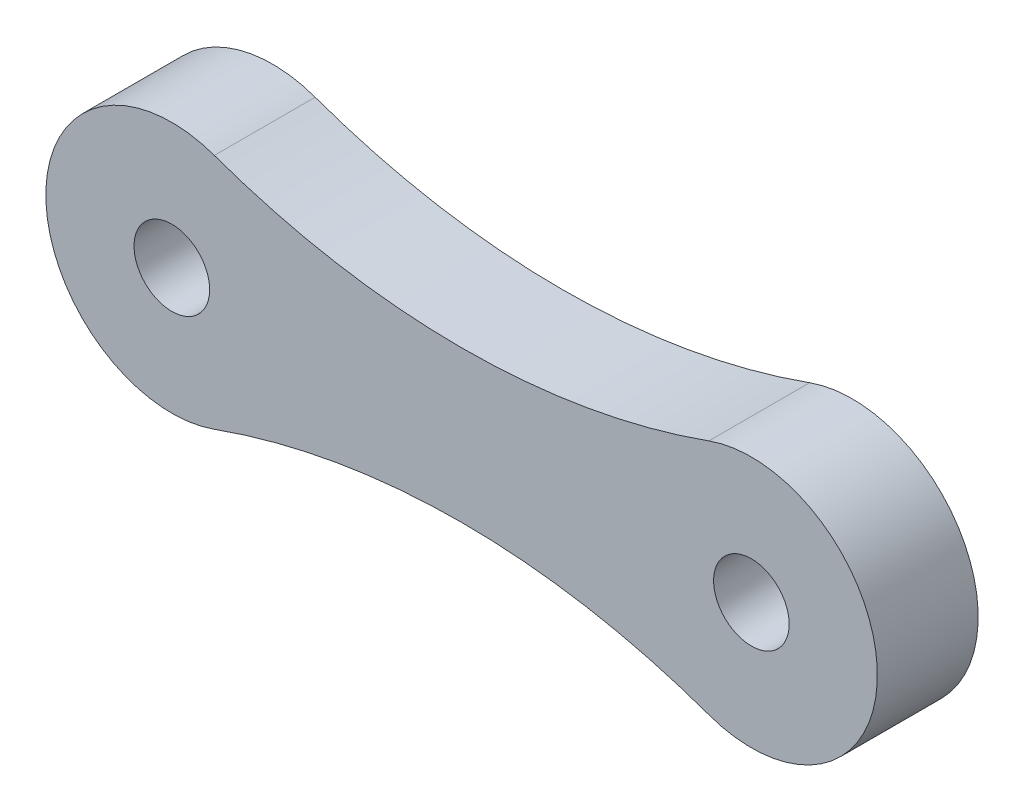
ISO-10303-21;
HEADER;
FILE_DESCRIPTION(('STEP AP214'),'2;1');
FILE_NAME('part.step','',(''),(''),'','','');
FILE_SCHEMA(('AUTOMOTIVE_DESIGN { 1 0 10303 214 1 1 1 1 }'));
ENDSEC;
DATA;
#1=APPLICATION_CONTEXT('core data for automotive mechanical design processes');
#2=APPLICATION_PROTOCOL_DEFINITION('international standard','automotive_design',2000,#1);
#3=PRODUCT_CONTEXT('',#1,'mechanical');
#4=PRODUCT('Part','Part','',(#3));
#5=PRODUCT_RELATED_PRODUCT_CATEGORY('part','',(#4));
#6=PRODUCT_DEFINITION_FORMATION('','',#4);
#7=PRODUCT_DEFINITION_CONTEXT('part definition',#1,'design');
#8=PRODUCT_DEFINITION('design','',#6,#7);
#9=PRODUCT_DEFINITION_SHAPE('','',#8);
#10=(LENGTH_UNIT() NAMED_UNIT(*) SI_UNIT(.MILLI.,.METRE.));
#11=(NAMED_UNIT(*) PLANE_ANGLE_UNIT() SI_UNIT($,.RADIAN.));
#12=(NAMED_UNIT(*) SI_UNIT($,.STERADIAN.) SOLID_ANGLE_UNIT());
#13=UNCERTAINTY_MEASURE_WITH_UNIT(LENGTH_MEASURE(1.E-05),#10,'distance_accuracy_value','');
#14=(GEOMETRIC_REPRESENTATION_CONTEXT(3) GLOBAL_UNCERTAINTY_ASSIGNED_CONTEXT((#13)) GLOBAL_UNIT_ASSIGNED_CONTEXT((#10,
#11,#12)) REPRESENTATION_CONTEXT('',''));
#15=CARTESIAN_POINT('',(0.,0.,0.));
#16=DIRECTION('',(0.,0.,1.));
#17=DIRECTION('',(1.,0.,0.));
#18=AXIS2_PLACEMENT_3D('',#15,#16,#17);
#19=CARTESIAN_POINT('',(-5.75,0.,2.));
#20=DIRECTION('',(0.,0.,-1.));
#21=DIRECTION('',(-1.,0.,0.));
#22=AXIS2_PLACEMENT_3D('',#19,#20,#21);
#23=CYLINDRICAL_SURFACE('',#22,2.5);
#24=CARTESIAN_POINT('',(-5.75,0.,0.));
#25=DIRECTION('',(0.,0.,1.));
#26=DIRECTION('',(1.,0.,0.));
#27=AXIS2_PLACEMENT_3D('',#24,#25,#26);
#28=CIRCLE('',#27,2.5);
#29=CARTESIAN_POINT('',(-4.90596330275229,2.35321100917431,0.));
#30=VERTEX_POINT('',#29);
#31=CARTESIAN_POINT('',(-4.90596330275229,-2.35321100917431,0.));
#32=VERTEX_POINT('',#31);
#33=EDGE_CURVE('E125',#30,#32,#28,.T.);
#34=ORIENTED_EDGE('',*,*,#33,.T.);
#35=DIRECTION('',(0.,0.,-1.));
#36=VECTOR('',#35,1.);
#37=CARTESIAN_POINT('',(-4.90596330275229,-2.35321100917431,2.));
#38=LINE('',#37,#36);
#39=CARTESIAN_POINT('',(-4.90596330275229,-2.35321100917431,2.));
#40=VERTEX_POINT('',#39);
#41=EDGE_CURVE('E11',#40,#32,#38,.T.);
#42=ORIENTED_EDGE('',*,*,#41,.F.);
#43=CARTESIAN_POINT('',(-5.75,0.,2.));
#44=DIRECTION('',(0.,0.,1.));
#45=DIRECTION('',(1.,0.,0.));
#46=AXIS2_PLACEMENT_3D('',#43,#44,#45);
#47=CIRCLE('',#46,2.5);
#48=CARTESIAN_POINT('',(-4.90596330275229,2.35321100917431,2.));
#49=VERTEX_POINT('',#48);
#50=EDGE_CURVE('E99',#49,#40,#47,.T.);
#51=ORIENTED_EDGE('',*,*,#50,.F.);
#52=DIRECTION('',(0.,0.,-1.));
#53=VECTOR('',#52,1.);
#54=CARTESIAN_POINT('',(-4.90596330275229,2.35321100917431,2.));
#55=LINE('',#54,#53);
#56=EDGE_CURVE('E65',#49,#30,#55,.T.);
#57=ORIENTED_EDGE('',*,*,#56,.T.);
#58=EDGE_LOOP('',(#34,#42,#51,#57));
#59=FACE_BOUND('',#58,.T.);
#60=ADVANCED_FACE('F47',(#59),#23,.T.);
#61=CARTESIAN_POINT('',(0.,-16.03125,2.));
#62=DIRECTION('',(0.,0.,-1.));
#63=DIRECTION('',(-1.,0.,0.));
#64=AXIS2_PLACEMENT_3D('',#61,#62,#63);
#65=CYLINDRICAL_SURFACE('',#64,14.53125);
#66=CARTESIAN_POINT('',(0.,-16.03125,0.));
#67=DIRECTION('',(0.,0.,1.));
#68=DIRECTION('',(1.,0.,0.));
#69=AXIS2_PLACEMENT_3D('',#66,#67,#68);
#70=CIRCLE('',#69,14.53125);
#71=CARTESIAN_POINT('',(4.90596330275229,-2.35321100917431,0.));
#72=VERTEX_POINT('',#71);
#73=EDGE_CURVE('E105',#32,#72,#70,.F.);
#74=ORIENTED_EDGE('',*,*,#73,.T.);
#75=DIRECTION('',(0.,0.,-1.));
#76=VECTOR('',#75,1.);
#77=CARTESIAN_POINT('',(4.90596330275229,-2.35321100917431,2.));
#78=LINE('',#77,#76);
#79=CARTESIAN_POINT('',(4.90596330275229,-2.35321100917431,2.));
#80=VERTEX_POINT('',#79);
#81=EDGE_CURVE('E57',#80,#72,#78,.T.);
#82=ORIENTED_EDGE('',*,*,#81,.F.);
#83=CARTESIAN_POINT('',(0.,-16.03125,2.));
#84=DIRECTION('',(0.,0.,1.));
#85=DIRECTION('',(1.,0.,0.));
#86=AXIS2_PLACEMENT_3D('',#83,#84,#85);
#87=CIRCLE('',#86,14.53125);
#88=EDGE_CURVE('E90',#40,#80,#87,.F.);
#89=ORIENTED_EDGE('',*,*,#88,.F.);
#90=ORIENTED_EDGE('',*,*,#41,.T.);
#91=EDGE_LOOP('',(#74,#82,#89,#90));
#92=FACE_BOUND('',#91,.T.);
#93=ADVANCED_FACE('F104',(#92),#65,.F.);
#94=CARTESIAN_POINT('',(5.75,0.,2.));
#95=DIRECTION('',(0.,0.,-1.));
#96=DIRECTION('',(-1.,0.,0.));
#97=AXIS2_PLACEMENT_3D('',#94,#95,#96);
#98=CYLINDRICAL_SURFACE('',#97,2.5);
#99=CARTESIAN_POINT('',(5.75,0.,0.));
#100=DIRECTION('',(0.,0.,1.));
#101=DIRECTION('',(1.,0.,0.));
#102=AXIS2_PLACEMENT_3D('',#99,#100,#101);
#103=CIRCLE('',#102,2.5);
#104=CARTESIAN_POINT('',(4.90596330275229,2.35321100917431,0.));
#105=VERTEX_POINT('',#104);
#106=EDGE_CURVE('E130',#105,#72,#103,.F.);
#107=ORIENTED_EDGE('',*,*,#106,.F.);
#108=DIRECTION('',(0.,0.,-1.));
#109=VECTOR('',#108,1.);
#110=CARTESIAN_POINT('',(4.90596330275229,2.35321100917431,2.));
#111=LINE('',#110,#109);
#112=CARTESIAN_POINT('',(4.90596330275229,2.35321100917431,2.));
#113=VERTEX_POINT('',#112);
#114=EDGE_CURVE('E79',#113,#105,#111,.T.);
#115=ORIENTED_EDGE('',*,*,#114,.F.);
#116=CARTESIAN_POINT('',(5.75,0.,2.));
#117=DIRECTION('',(0.,0.,1.));
#118=DIRECTION('',(1.,0.,0.));
#119=AXIS2_PLACEMENT_3D('',#116,#117,#118);
#120=CIRCLE('',#119,2.5);
#121=EDGE_CURVE('E98',#113,#80,#120,.F.);
#122=ORIENTED_EDGE('',*,*,#121,.T.);
#123=ORIENTED_EDGE('',*,*,#81,.T.);
#124=EDGE_LOOP('',(#107,#115,#122,#123));
#125=FACE_BOUND('',#124,.T.);
#126=ADVANCED_FACE('F109',(#125),#98,.T.);
#127=CARTESIAN_POINT('',(0.,16.03125,2.));
#128=DIRECTION('',(0.,0.,-1.));
#129=DIRECTION('',(-1.,0.,0.));
#130=AXIS2_PLACEMENT_3D('',#127,#128,#129);
#131=CYLINDRICAL_SURFACE('',#130,14.53125);
#132=CARTESIAN_POINT('',(0.,16.03125,0.));
#133=DIRECTION('',(0.,0.,1.));
#134=DIRECTION('',(1.,0.,0.));
#135=AXIS2_PLACEMENT_3D('',#132,#133,#134);
#136=CIRCLE('',#135,14.53125);
#137=EDGE_CURVE('E133',#30,#105,#136,.T.);
#138=ORIENTED_EDGE('',*,*,#137,.F.);
#139=ORIENTED_EDGE('',*,*,#56,.F.);
#140=CARTESIAN_POINT('',(0.,16.03125,2.));
#141=DIRECTION('',(0.,0.,1.));
#142=DIRECTION('',(1.,0.,0.));
#143=AXIS2_PLACEMENT_3D('',#140,#141,#142);
#144=CIRCLE('',#143,14.53125);
#145=EDGE_CURVE('E111',#49,#113,#144,.T.);
#146=ORIENTED_EDGE('',*,*,#145,.T.);
#147=ORIENTED_EDGE('',*,*,#114,.T.);
#148=EDGE_LOOP('',(#138,#139,#146,#147));
#149=FACE_BOUND('',#148,.T.);
#150=ADVANCED_FACE('F175',(#149),#131,.F.);
#151=CARTESIAN_POINT('',(-5.75,0.,2.));
#152=DIRECTION('',(0.,0.,-1.));
#153=DIRECTION('',(-1.,0.,0.));
#154=AXIS2_PLACEMENT_3D('',#151,#152,#153);
#155=CYLINDRICAL_SURFACE('',#154,0.75);
#156=CARTESIAN_POINT('',(-5.75,0.,2.));
#157=DIRECTION('',(0.,0.,1.));
#158=DIRECTION('',(1.,0.,0.));
#159=AXIS2_PLACEMENT_3D('',#156,#157,#158);
#160=CIRCLE('',#159,0.75);
#161=CARTESIAN_POINT('',(-5.,0.,2.));
#162=VERTEX_POINT('',#161);
#163=EDGE_CURVE('E141',#162,#162,#160,.T.);
#164=ORIENTED_EDGE('',*,*,#163,.T.);
#165=EDGE_LOOP('',(#164));
#166=FACE_BOUND('',#165,.T.);
#167=CARTESIAN_POINT('',(-5.75,0.,0.));
#168=DIRECTION('',(0.,0.,1.));
#169=DIRECTION('',(1.,0.,0.));
#170=AXIS2_PLACEMENT_3D('',#167,#168,#169);
#171=CIRCLE('',#170,0.75);
#172=CARTESIAN_POINT('',(-5.,0.,0.));
#173=VERTEX_POINT('',#172);
#174=EDGE_CURVE('E121',#173,#173,#171,.T.);
#175=ORIENTED_EDGE('',*,*,#174,.F.);
#176=EDGE_LOOP('',(#175));
#177=FACE_BOUND('',#176,.T.);
#178=ADVANCED_FACE('F49',(#166,#177),#155,.F.);
#179=CARTESIAN_POINT('',(5.75,0.,2.));
#180=DIRECTION('',(0.,0.,-1.));
#181=DIRECTION('',(-1.,0.,0.));
#182=AXIS2_PLACEMENT_3D('',#179,#180,#181);
#183=CYLINDRICAL_SURFACE('',#182,0.75);
#184=CARTESIAN_POINT('',(5.75,0.,2.));
#185=DIRECTION('',(0.,0.,1.));
#186=DIRECTION('',(1.,0.,0.));
#187=AXIS2_PLACEMENT_3D('',#184,#185,#186);
#188=CIRCLE('',#187,0.75);
#189=CARTESIAN_POINT('',(6.5,0.,2.));
#190=VERTEX_POINT('',#189);
#191=EDGE_CURVE('E114',#190,#190,#188,.F.);
#192=ORIENTED_EDGE('',*,*,#191,.F.);
#193=EDGE_LOOP('',(#192));
#194=FACE_BOUND('',#193,.T.);
#195=CARTESIAN_POINT('',(5.75,0.,0.));
#196=DIRECTION('',(0.,0.,1.));
#197=DIRECTION('',(1.,0.,0.));
#198=AXIS2_PLACEMENT_3D('',#195,#196,#197);
#199=CIRCLE('',#198,0.75);
#200=CARTESIAN_POINT('',(6.5,0.,0.));
#201=VERTEX_POINT('',#200);
#202=EDGE_CURVE('E137',#201,#201,#199,.F.);
#203=ORIENTED_EDGE('',*,*,#202,.T.);
#204=EDGE_LOOP('',(#203));
#205=FACE_BOUND('',#204,.T.);
#206=ADVANCED_FACE('F157',(#194,#205),#183,.F.);
#207=CARTESIAN_POINT('',(0.,0.,2.));
#208=DIRECTION('',(0.,0.,1.));
#209=DIRECTION('',(1.,0.,0.));
#210=AXIS2_PLACEMENT_3D('',#207,#208,#209);
#211=PLANE('',#210);
#212=ORIENTED_EDGE('',*,*,#163,.F.);
#213=EDGE_LOOP('',(#212));
#214=FACE_BOUND('',#213,.T.);
#215=ORIENTED_EDGE('',*,*,#50,.T.);
#216=ORIENTED_EDGE('',*,*,#88,.T.);
#217=ORIENTED_EDGE('',*,*,#121,.F.);
#218=ORIENTED_EDGE('',*,*,#145,.F.);
#219=EDGE_LOOP('',(#215,#216,#217,#218));
#220=FACE_BOUND('',#219,.T.);
#221=ORIENTED_EDGE('',*,*,#191,.T.);
#222=EDGE_LOOP('',(#221));
#223=FACE_BOUND('',#222,.T.);
#224=ADVANCED_FACE('F94',(#214,#220,#223),#211,.T.);
#225=CARTESIAN_POINT('',(0.,0.,0.));
#226=DIRECTION('',(0.,0.,1.));
#227=DIRECTION('',(1.,0.,0.));
#228=AXIS2_PLACEMENT_3D('',#225,#226,#227);
#229=PLANE('',#228);
#230=ORIENTED_EDGE('',*,*,#174,.T.);
#231=EDGE_LOOP('',(#230));
#232=FACE_BOUND('',#231,.T.);
#233=ORIENTED_EDGE('',*,*,#33,.F.);
#234=ORIENTED_EDGE('',*,*,#137,.T.);
#235=ORIENTED_EDGE('',*,*,#106,.T.);
#236=ORIENTED_EDGE('',*,*,#73,.F.);
#237=EDGE_LOOP('',(#233,#234,#235,#236));
#238=FACE_BOUND('',#237,.T.);
#239=ORIENTED_EDGE('',*,*,#202,.F.);
#240=EDGE_LOOP('',(#239));
#241=FACE_BOUND('',#240,.T.);
#242=ADVANCED_FACE('F156',(#232,#238,#241),#229,.F.);
#243=CLOSED_SHELL('',(#60,#93,#126,#150,#178,#206,#224,#242));
#244=MANIFOLD_SOLID_BREP('B2',#243);
#245=ADVANCED_BREP_SHAPE_REPRESENTATION('',(#18,#244),#14);
#246=SHAPE_DEFINITION_REPRESENTATION(#9,#245);
ENDSEC;
END-ISO-10303-21;
